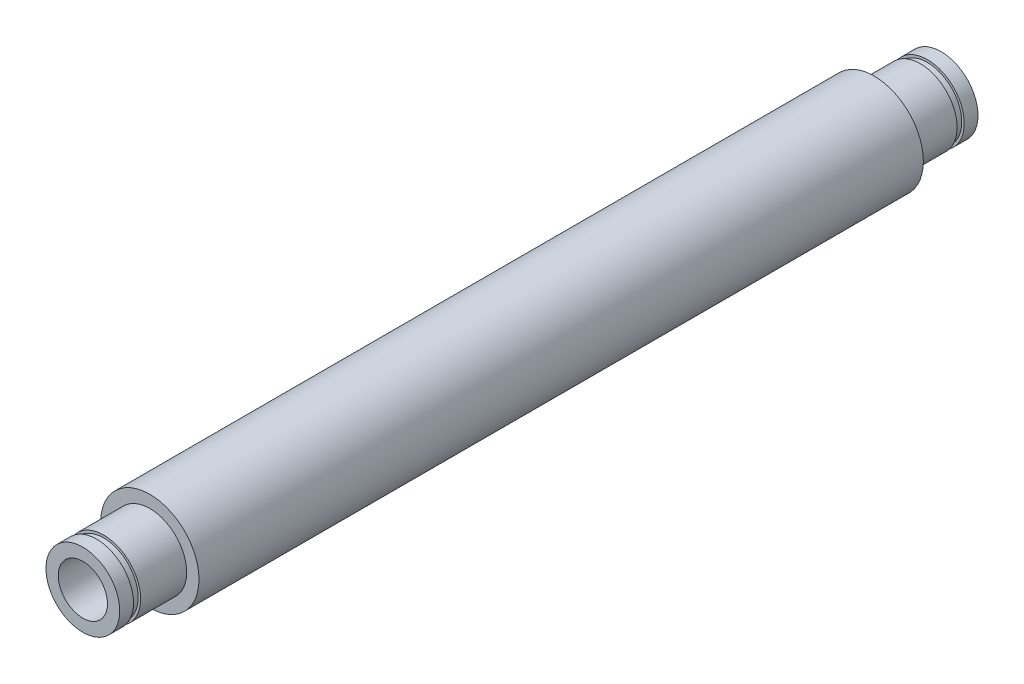
ISO-10303-21;
HEADER;
FILE_DESCRIPTION(('STEP AP214'),'2;1');
FILE_NAME('part.step','',(''),(''),'','','');
FILE_SCHEMA(('AUTOMOTIVE_DESIGN { 1 0 10303 214 1 1 1 1 }'));
ENDSEC;
DATA;
#1=APPLICATION_CONTEXT('core data for automotive mechanical design processes');
#2=APPLICATION_PROTOCOL_DEFINITION('international standard','automotive_design',2000,#1);
#3=PRODUCT_CONTEXT('',#1,'mechanical');
#4=PRODUCT('Part','Part','',(#3));
#5=PRODUCT_RELATED_PRODUCT_CATEGORY('part','',(#4));
#6=PRODUCT_DEFINITION_FORMATION('','',#4);
#7=PRODUCT_DEFINITION_CONTEXT('part definition',#1,'design');
#8=PRODUCT_DEFINITION('design','',#6,#7);
#9=PRODUCT_DEFINITION_SHAPE('','',#8);
#10=(LENGTH_UNIT() NAMED_UNIT(*) SI_UNIT(.MILLI.,.METRE.));
#11=(NAMED_UNIT(*) PLANE_ANGLE_UNIT() SI_UNIT($,.RADIAN.));
#12=(NAMED_UNIT(*) SI_UNIT($,.STERADIAN.) SOLID_ANGLE_UNIT());
#13=UNCERTAINTY_MEASURE_WITH_UNIT(LENGTH_MEASURE(1.E-05),#10,'distance_accuracy_value','');
#14=(GEOMETRIC_REPRESENTATION_CONTEXT(3) GLOBAL_UNCERTAINTY_ASSIGNED_CONTEXT((#13)) GLOBAL_UNIT_ASSIGNED_CONTEXT((#10,
#11,#12)) REPRESENTATION_CONTEXT('',''));
#15=CARTESIAN_POINT('',(0.,0.,0.));
#16=DIRECTION('',(0.,0.,1.));
#17=DIRECTION('',(1.,0.,0.));
#18=AXIS2_PLACEMENT_3D('',#15,#16,#17);
#19=CARTESIAN_POINT('',(0.,0.,-23.368));
#20=DIRECTION('',(0.,0.,-1.));
#21=DIRECTION('',(-1.,0.,0.));
#22=AXIS2_PLACEMENT_3D('',#19,#20,#21);
#23=CYLINDRICAL_SURFACE('',#22,2.38125);
#24=CARTESIAN_POINT('',(0.,0.,-23.368));
#25=DIRECTION('',(0.,0.,1.));
#26=DIRECTION('',(1.,0.,0.));
#27=AXIS2_PLACEMENT_3D('',#24,#25,#26);
#28=CIRCLE('',#27,2.38125);
#29=CARTESIAN_POINT('',(2.38125,0.,-23.368));
#30=VERTEX_POINT('',#29);
#31=EDGE_CURVE('E84',#30,#30,#28,.T.);
#32=ORIENTED_EDGE('',*,*,#31,.F.);
#33=EDGE_LOOP('',(#32));
#34=FACE_BOUND('',#33,.T.);
#35=CARTESIAN_POINT('',(0.,0.,-26.3398));
#36=DIRECTION('',(0.,0.,1.));
#37=DIRECTION('',(1.,0.,0.));
#38=AXIS2_PLACEMENT_3D('',#35,#36,#37);
#39=CIRCLE('',#38,2.38125);
#40=CARTESIAN_POINT('',(2.38125,0.,-26.3398));
#41=VERTEX_POINT('',#40);
#42=EDGE_CURVE('E88',#41,#41,#39,.T.);
#43=ORIENTED_EDGE('',*,*,#42,.T.);
#44=EDGE_LOOP('',(#43));
#45=FACE_BOUND('',#44,.T.);
#46=ADVANCED_FACE('F46',(#34,#45),#23,.T.);
#47=CARTESIAN_POINT('',(0.,0.,27.686));
#48=DIRECTION('',(0.,0.,-1.));
#49=DIRECTION('',(-1.,0.,0.));
#50=AXIS2_PLACEMENT_3D('',#47,#48,#49);
#51=CYLINDRICAL_SURFACE('',#50,3.175);
#52=CARTESIAN_POINT('',(0.,0.,23.368));
#53=DIRECTION('',(0.,0.,1.));
#54=DIRECTION('',(1.,0.,0.));
#55=AXIS2_PLACEMENT_3D('',#52,#53,#54);
#56=CIRCLE('',#55,3.175);
#57=CARTESIAN_POINT('',(3.175,0.,23.368));
#58=VERTEX_POINT('',#57);
#59=EDGE_CURVE('E12',#58,#58,#56,.T.);
#60=ORIENTED_EDGE('',*,*,#59,.F.);
#61=EDGE_LOOP('',(#60));
#62=FACE_BOUND('',#61,.T.);
#63=CARTESIAN_POINT('',(0.,0.,-23.368));
#64=DIRECTION('',(0.,0.,1.));
#65=DIRECTION('',(1.,0.,0.));
#66=AXIS2_PLACEMENT_3D('',#63,#64,#65);
#67=CIRCLE('',#66,3.175);
#68=CARTESIAN_POINT('',(3.175,0.,-23.368));
#69=VERTEX_POINT('',#68);
#70=EDGE_CURVE('E79',#69,#69,#67,.T.);
#71=ORIENTED_EDGE('',*,*,#70,.T.);
#72=EDGE_LOOP('',(#71));
#73=FACE_BOUND('',#72,.T.);
#74=ADVANCED_FACE('F48',(#62,#73),#51,.T.);
#75=CARTESIAN_POINT('',(0.,0.,23.368));
#76=DIRECTION('',(0.,0.,1.));
#77=DIRECTION('',(1.,0.,0.));
#78=AXIS2_PLACEMENT_3D('',#75,#76,#77);
#79=CYLINDRICAL_SURFACE('',#78,2.38125);
#80=CARTESIAN_POINT('',(0.,0.,23.368));
#81=DIRECTION('',(0.,0.,1.));
#82=DIRECTION('',(1.,0.,0.));
#83=AXIS2_PLACEMENT_3D('',#80,#81,#82);
#84=CIRCLE('',#83,2.38125);
#85=CARTESIAN_POINT('',(2.38125,0.,23.368));
#86=VERTEX_POINT('',#85);
#87=EDGE_CURVE('E53',#86,#86,#84,.T.);
#88=ORIENTED_EDGE('',*,*,#87,.T.);
#89=EDGE_LOOP('',(#88));
#90=FACE_BOUND('',#89,.T.);
#91=CARTESIAN_POINT('',(0.,0.,26.3398));
#92=DIRECTION('',(0.,0.,1.));
#93=DIRECTION('',(1.,0.,0.));
#94=AXIS2_PLACEMENT_3D('',#91,#92,#93);
#95=CIRCLE('',#94,2.38125);
#96=CARTESIAN_POINT('',(2.38125,0.,26.3398));
#97=VERTEX_POINT('',#96);
#98=EDGE_CURVE('E62',#97,#97,#95,.T.);
#99=ORIENTED_EDGE('',*,*,#98,.F.);
#100=EDGE_LOOP('',(#99));
#101=FACE_BOUND('',#100,.T.);
#102=ADVANCED_FACE('F127',(#90,#101),#79,.T.);
#103=CARTESIAN_POINT('',(0.,0.,-27.686));
#104=DIRECTION('',(0.,0.,1.));
#105=DIRECTION('',(1.,0.,0.));
#106=AXIS2_PLACEMENT_3D('',#103,#104,#105);
#107=PLANE('',#106);
#108=CARTESIAN_POINT('',(0.,0.,-27.686));
#109=DIRECTION('',(0.,0.,1.));
#110=DIRECTION('',(1.,0.,0.));
#111=AXIS2_PLACEMENT_3D('',#108,#109,#110);
#112=CIRCLE('',#111,2.38125);
#113=CARTESIAN_POINT('',(2.38125,0.,-27.686));
#114=VERTEX_POINT('',#113);
#115=EDGE_CURVE('E85',#114,#114,#112,.T.);
#116=ORIENTED_EDGE('',*,*,#115,.F.);
#117=EDGE_LOOP('',(#116));
#118=FACE_BOUND('',#117,.T.);
#119=CARTESIAN_POINT('',(0.,0.,-27.686));
#120=DIRECTION('',(0.,0.,1.));
#121=DIRECTION('',(1.,0.,0.));
#122=AXIS2_PLACEMENT_3D('',#119,#120,#121);
#123=CIRCLE('',#122,1.5875);
#124=CARTESIAN_POINT('',(1.5875,0.,-27.686));
#125=VERTEX_POINT('',#124);
#126=EDGE_CURVE('E73',#125,#125,#123,.T.);
#127=ORIENTED_EDGE('',*,*,#126,.T.);
#128=EDGE_LOOP('',(#127));
#129=FACE_BOUND('',#128,.T.);
#130=ADVANCED_FACE('F144',(#118,#129),#107,.F.);
#131=CARTESIAN_POINT('',(0.,0.,23.368));
#132=DIRECTION('',(0.,0.,1.));
#133=DIRECTION('',(1.,0.,0.));
#134=AXIS2_PLACEMENT_3D('',#131,#132,#133);
#135=PLANE('',#134);
#136=ORIENTED_EDGE('',*,*,#87,.F.);
#137=EDGE_LOOP('',(#136));
#138=FACE_BOUND('',#137,.T.);
#139=ORIENTED_EDGE('',*,*,#59,.T.);
#140=EDGE_LOOP('',(#139));
#141=FACE_BOUND('',#140,.T.);
#142=ADVANCED_FACE('F147',(#138,#141),#135,.T.);
#143=CARTESIAN_POINT('',(0.,0.,26.3398));
#144=DIRECTION('',(0.,0.,1.));
#145=DIRECTION('',(1.,0.,0.));
#146=AXIS2_PLACEMENT_3D('',#143,#144,#145);
#147=PLANE('',#146);
#148=CARTESIAN_POINT('',(0.,0.,26.3398));
#149=DIRECTION('',(0.,0.,1.));
#150=DIRECTION('',(1.,0.,0.));
#151=AXIS2_PLACEMENT_3D('',#148,#149,#150);
#152=CIRCLE('',#151,2.2225);
#153=CARTESIAN_POINT('',(2.2225,0.,26.3398));
#154=VERTEX_POINT('',#153);
#155=EDGE_CURVE('E67',#154,#154,#152,.T.);
#156=ORIENTED_EDGE('',*,*,#155,.F.);
#157=EDGE_LOOP('',(#156));
#158=FACE_BOUND('',#157,.T.);
#159=ORIENTED_EDGE('',*,*,#98,.T.);
#160=EDGE_LOOP('',(#159));
#161=FACE_BOUND('',#160,.T.);
#162=ADVANCED_FACE('F176',(#158,#161),#147,.T.);
#163=CARTESIAN_POINT('',(0.,0.,26.797));
#164=DIRECTION('',(0.,0.,1.));
#165=DIRECTION('',(1.,0.,0.));
#166=AXIS2_PLACEMENT_3D('',#163,#164,#165);
#167=PLANE('',#166);
#168=CARTESIAN_POINT('',(0.,0.,26.797));
#169=DIRECTION('',(0.,0.,1.));
#170=DIRECTION('',(1.,0.,0.));
#171=AXIS2_PLACEMENT_3D('',#168,#169,#170);
#172=CIRCLE('',#171,2.2225);
#173=CARTESIAN_POINT('',(2.2225,0.,26.797));
#174=VERTEX_POINT('',#173);
#175=EDGE_CURVE('E70',#174,#174,#172,.T.);
#176=ORIENTED_EDGE('',*,*,#175,.T.);
#177=EDGE_LOOP('',(#176));
#178=FACE_BOUND('',#177,.T.);
#179=CARTESIAN_POINT('',(0.,0.,26.797));
#180=DIRECTION('',(0.,0.,1.));
#181=DIRECTION('',(1.,0.,0.));
#182=AXIS2_PLACEMENT_3D('',#179,#180,#181);
#183=CIRCLE('',#182,2.38125);
#184=CARTESIAN_POINT('',(2.38125,0.,26.797));
#185=VERTEX_POINT('',#184);
#186=EDGE_CURVE('E64',#185,#185,#183,.T.);
#187=ORIENTED_EDGE('',*,*,#186,.F.);
#188=EDGE_LOOP('',(#187));
#189=FACE_BOUND('',#188,.T.);
#190=ADVANCED_FACE('F178',(#178,#189),#167,.F.);
#191=CARTESIAN_POINT('',(0.,0.,26.3398));
#192=DIRECTION('',(0.,0.,1.));
#193=DIRECTION('',(1.,0.,0.));
#194=AXIS2_PLACEMENT_3D('',#191,#192,#193);
#195=CYLINDRICAL_SURFACE('',#194,2.2225);
#196=ORIENTED_EDGE('',*,*,#155,.T.);
#197=EDGE_LOOP('',(#196));
#198=FACE_BOUND('',#197,.T.);
#199=ORIENTED_EDGE('',*,*,#175,.F.);
#200=EDGE_LOOP('',(#199));
#201=FACE_BOUND('',#200,.T.);
#202=ADVANCED_FACE('F159',(#198,#201),#195,.T.);
#203=CARTESIAN_POINT('',(0.,0.,27.686));
#204=DIRECTION('',(0.,0.,1.));
#205=DIRECTION('',(1.,0.,0.));
#206=AXIS2_PLACEMENT_3D('',#203,#204,#205);
#207=PLANE('',#206);
#208=CARTESIAN_POINT('',(0.,0.,27.686));
#209=DIRECTION('',(0.,0.,1.));
#210=DIRECTION('',(1.,0.,0.));
#211=AXIS2_PLACEMENT_3D('',#208,#209,#210);
#212=CIRCLE('',#211,1.5875);
#213=CARTESIAN_POINT('',(1.5875,0.,27.686));
#214=VERTEX_POINT('',#213);
#215=EDGE_CURVE('E76',#214,#214,#212,.T.);
#216=ORIENTED_EDGE('',*,*,#215,.F.);
#217=EDGE_LOOP('',(#216));
#218=FACE_BOUND('',#217,.T.);
#219=CARTESIAN_POINT('',(0.,0.,27.686));
#220=DIRECTION('',(0.,0.,1.));
#221=DIRECTION('',(1.,0.,0.));
#222=AXIS2_PLACEMENT_3D('',#219,#220,#221);
#223=CIRCLE('',#222,2.38125);
#224=CARTESIAN_POINT('',(2.38125,0.,27.686));
#225=VERTEX_POINT('',#224);
#226=EDGE_CURVE('E57',#225,#225,#223,.T.);
#227=ORIENTED_EDGE('',*,*,#226,.T.);
#228=EDGE_LOOP('',(#227));
#229=FACE_BOUND('',#228,.T.);
#230=ADVANCED_FACE('F156',(#218,#229),#207,.T.);
#231=ORIENTED_EDGE('',*,*,#186,.T.);
#232=EDGE_LOOP('',(#231));
#233=FACE_BOUND('',#232,.T.);
#234=ORIENTED_EDGE('',*,*,#226,.F.);
#235=EDGE_LOOP('',(#234));
#236=FACE_BOUND('',#235,.T.);
#237=ADVANCED_FACE('F152',(#233,#236),#79,.T.);
#238=CARTESIAN_POINT('',(0.,0.,-27.686));
#239=DIRECTION('',(0.,0.,1.));
#240=DIRECTION('',(1.,0.,0.));
#241=AXIS2_PLACEMENT_3D('',#238,#239,#240);
#242=CYLINDRICAL_SURFACE('',#241,1.5875);
#243=ORIENTED_EDGE('',*,*,#126,.F.);
#244=EDGE_LOOP('',(#243));
#245=FACE_BOUND('',#244,.T.);
#246=ORIENTED_EDGE('',*,*,#215,.T.);
#247=EDGE_LOOP('',(#246));
#248=FACE_BOUND('',#247,.T.);
#249=ADVANCED_FACE('F138',(#245,#248),#242,.F.);
#250=CARTESIAN_POINT('',(0.,0.,-23.368));
#251=DIRECTION('',(0.,0.,-1.));
#252=DIRECTION('',(1.,0.,0.));
#253=AXIS2_PLACEMENT_3D('',#250,#251,#252);
#254=PLANE('',#253);
#255=ORIENTED_EDGE('',*,*,#70,.F.);
#256=EDGE_LOOP('',(#255));
#257=FACE_BOUND('',#256,.T.);
#258=ORIENTED_EDGE('',*,*,#31,.T.);
#259=EDGE_LOOP('',(#258));
#260=FACE_BOUND('',#259,.T.);
#261=ADVANCED_FACE('F133',(#257,#260),#254,.T.);
#262=CARTESIAN_POINT('',(0.,0.,-26.797));
#263=DIRECTION('',(0.,0.,1.));
#264=DIRECTION('',(1.,0.,0.));
#265=AXIS2_PLACEMENT_3D('',#262,#263,#264);
#266=CIRCLE('',#265,2.38125);
#267=CARTESIAN_POINT('',(2.38125,0.,-26.797));
#268=VERTEX_POINT('',#267);
#269=EDGE_CURVE('E91',#268,#268,#266,.T.);
#270=ORIENTED_EDGE('',*,*,#269,.F.);
#271=EDGE_LOOP('',(#270));
#272=FACE_BOUND('',#271,.T.);
#273=ORIENTED_EDGE('',*,*,#115,.T.);
#274=EDGE_LOOP('',(#273));
#275=FACE_BOUND('',#274,.T.);
#276=ADVANCED_FACE('F118',(#272,#275),#23,.T.);
#277=CARTESIAN_POINT('',(0.,0.,-26.3398));
#278=DIRECTION('',(0.,0.,-1.));
#279=DIRECTION('',(1.,0.,0.));
#280=AXIS2_PLACEMENT_3D('',#277,#278,#279);
#281=PLANE('',#280);
#282=ORIENTED_EDGE('',*,*,#42,.F.);
#283=EDGE_LOOP('',(#282));
#284=FACE_BOUND('',#283,.T.);
#285=CARTESIAN_POINT('',(0.,0.,-26.3398));
#286=DIRECTION('',(0.,0.,1.));
#287=DIRECTION('',(1.,0.,0.));
#288=AXIS2_PLACEMENT_3D('',#285,#286,#287);
#289=CIRCLE('',#288,2.2225);
#290=CARTESIAN_POINT('',(2.2225,0.,-26.3398));
#291=VERTEX_POINT('',#290);
#292=EDGE_CURVE('E94',#291,#291,#289,.T.);
#293=ORIENTED_EDGE('',*,*,#292,.T.);
#294=EDGE_LOOP('',(#293));
#295=FACE_BOUND('',#294,.T.);
#296=ADVANCED_FACE('F103',(#284,#295),#281,.T.);
#297=CARTESIAN_POINT('',(0.,0.,-26.797));
#298=DIRECTION('',(0.,0.,-1.));
#299=DIRECTION('',(1.,0.,0.));
#300=AXIS2_PLACEMENT_3D('',#297,#298,#299);
#301=PLANE('',#300);
#302=ORIENTED_EDGE('',*,*,#269,.T.);
#303=EDGE_LOOP('',(#302));
#304=FACE_BOUND('',#303,.T.);
#305=CARTESIAN_POINT('',(0.,0.,-26.797));
#306=DIRECTION('',(0.,0.,1.));
#307=DIRECTION('',(1.,0.,0.));
#308=AXIS2_PLACEMENT_3D('',#305,#306,#307);
#309=CIRCLE('',#308,2.2225);
#310=CARTESIAN_POINT('',(2.2225,0.,-26.797));
#311=VERTEX_POINT('',#310);
#312=EDGE_CURVE('E97',#311,#311,#309,.T.);
#313=ORIENTED_EDGE('',*,*,#312,.F.);
#314=EDGE_LOOP('',(#313));
#315=FACE_BOUND('',#314,.T.);
#316=ADVANCED_FACE('F108',(#304,#315),#301,.F.);
#317=CARTESIAN_POINT('',(0.,0.,-26.3398));
#318=DIRECTION('',(0.,0.,-1.));
#319=DIRECTION('',(-1.,0.,0.));
#320=AXIS2_PLACEMENT_3D('',#317,#318,#319);
#321=CYLINDRICAL_SURFACE('',#320,2.2225);
#322=ORIENTED_EDGE('',*,*,#292,.F.);
#323=EDGE_LOOP('',(#322));
#324=FACE_BOUND('',#323,.T.);
#325=ORIENTED_EDGE('',*,*,#312,.T.);
#326=EDGE_LOOP('',(#325));
#327=FACE_BOUND('',#326,.T.);
#328=ADVANCED_FACE('F105',(#324,#327),#321,.T.);
#329=CLOSED_SHELL('',(#46,#74,#102,#130,#142,#162,#190,#202,#230,#237,#249,#261,#276,#296,#316,#328));
#330=MANIFOLD_SOLID_BREP('B2',#329);
#331=ADVANCED_BREP_SHAPE_REPRESENTATION('',(#18,#330),#14);
#332=SHAPE_DEFINITION_REPRESENTATION(#9,#331);
ENDSEC;
END-ISO-10303-21;
